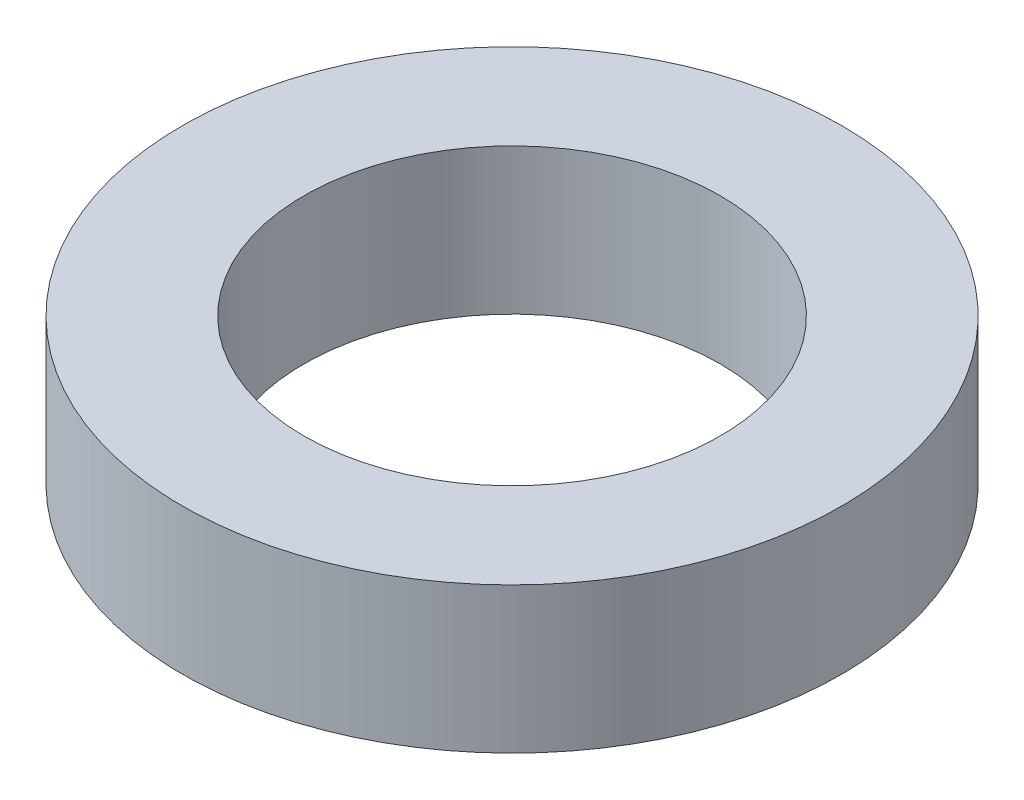
ISO-10303-21;
HEADER;
FILE_DESCRIPTION(('STEP AP214'),'2;1');
FILE_NAME('part.step','',(''),(''),'','','');
FILE_SCHEMA(('AUTOMOTIVE_DESIGN { 1 0 10303 214 1 1 1 1 }'));
ENDSEC;
DATA;
#1=APPLICATION_CONTEXT('core data for automotive mechanical design processes');
#2=APPLICATION_PROTOCOL_DEFINITION('international standard','automotive_design',2000,#1);
#3=PRODUCT_CONTEXT('',#1,'mechanical');
#4=PRODUCT('Part','Part','',(#3));
#5=PRODUCT_RELATED_PRODUCT_CATEGORY('part','',(#4));
#6=PRODUCT_DEFINITION_FORMATION('','',#4);
#7=PRODUCT_DEFINITION_CONTEXT('part definition',#1,'design');
#8=PRODUCT_DEFINITION('design','',#6,#7);
#9=PRODUCT_DEFINITION_SHAPE('','',#8);
#10=(LENGTH_UNIT() NAMED_UNIT(*) SI_UNIT(.MILLI.,.METRE.));
#11=(NAMED_UNIT(*) PLANE_ANGLE_UNIT() SI_UNIT($,.RADIAN.));
#12=(NAMED_UNIT(*) SI_UNIT($,.STERADIAN.) SOLID_ANGLE_UNIT());
#13=UNCERTAINTY_MEASURE_WITH_UNIT(LENGTH_MEASURE(1.E-05),#10,'distance_accuracy_value','');
#14=(GEOMETRIC_REPRESENTATION_CONTEXT(3) GLOBAL_UNCERTAINTY_ASSIGNED_CONTEXT((#13)) GLOBAL_UNIT_ASSIGNED_CONTEXT((#10,
#11,#12)) REPRESENTATION_CONTEXT('',''));
#15=CARTESIAN_POINT('',(0.,0.,0.));
#16=DIRECTION('',(0.,0.,1.));
#17=DIRECTION('',(1.,0.,0.));
#18=AXIS2_PLACEMENT_3D('',#15,#16,#17);
#19=CARTESIAN_POINT('',(0.,21.,0.));
#20=DIRECTION('',(0.,-1.,0.));
#21=DIRECTION('',(0.,0.,-1.));
#22=AXIS2_PLACEMENT_3D('',#19,#20,#21);
#23=CYLINDRICAL_SURFACE('',#22,47.5);
#24=CARTESIAN_POINT('',(0.,21.,0.));
#25=DIRECTION('',(0.,1.,0.));
#26=DIRECTION('',(0.,0.,1.));
#27=AXIS2_PLACEMENT_3D('',#24,#25,#26);
#28=CIRCLE('',#27,47.5);
#29=CARTESIAN_POINT('',(0.,21.,-47.5));
#30=VERTEX_POINT('',#29);
#31=EDGE_CURVE('E10',#30,#30,#28,.T.);
#32=CARTESIAN_POINT('',(0.,0.,0.));
#33=DIRECTION('',(0.,1.,0.));
#34=DIRECTION('',(0.,0.,1.));
#35=AXIS2_PLACEMENT_3D('',#32,#33,#34);
#36=CIRCLE('',#35,47.5);
#37=CARTESIAN_POINT('',(0.,0.,-47.5));
#38=VERTEX_POINT('',#37);
#39=EDGE_CURVE('E37',#38,#38,#36,.T.);
#40=CARTESIAN_POINT('',(0.,21.,-47.5));
#41=CARTESIAN_POINT('',(0.,20.78125,-47.5));
#42=CARTESIAN_POINT('',(0.,20.5625,-47.5));
#43=CARTESIAN_POINT('',(0.,20.125,-47.5));
#44=CARTESIAN_POINT('',(0.,19.90625,-47.5));
#45=CARTESIAN_POINT('',(0.,19.46875,-47.5));
#46=CARTESIAN_POINT('',(0.,19.25,-47.5));
#47=CARTESIAN_POINT('',(0.,18.8125,-47.5));
#48=CARTESIAN_POINT('',(0.,18.59375,-47.5));
#49=CARTESIAN_POINT('',(0.,18.15625,-47.5));
#50=CARTESIAN_POINT('',(0.,17.9375,-47.5));
#51=CARTESIAN_POINT('',(0.,17.5,-47.5));
#52=CARTESIAN_POINT('',(0.,17.28125,-47.5));
#53=CARTESIAN_POINT('',(0.,16.84375,-47.5));
#54=CARTESIAN_POINT('',(0.,16.625,-47.5));
#55=CARTESIAN_POINT('',(0.,16.1875,-47.5));
#56=CARTESIAN_POINT('',(0.,15.96875,-47.5));
#57=CARTESIAN_POINT('',(0.,15.53125,-47.5));
#58=CARTESIAN_POINT('',(0.,15.3125,-47.5));
#59=CARTESIAN_POINT('',(0.,14.875,-47.5));
#60=CARTESIAN_POINT('',(0.,14.65625,-47.5));
#61=CARTESIAN_POINT('',(0.,14.21875,-47.5));
#62=CARTESIAN_POINT('',(0.,14.,-47.5));
#63=CARTESIAN_POINT('',(0.,13.5625,-47.5));
#64=CARTESIAN_POINT('',(0.,13.34375,-47.5));
#65=CARTESIAN_POINT('',(0.,12.90625,-47.5));
#66=CARTESIAN_POINT('',(0.,12.6875,-47.5));
#67=CARTESIAN_POINT('',(0.,12.25,-47.5));
#68=CARTESIAN_POINT('',(0.,12.03125,-47.5));
#69=CARTESIAN_POINT('',(0.,11.59375,-47.5));
#70=CARTESIAN_POINT('',(0.,11.375,-47.5));
#71=CARTESIAN_POINT('',(0.,10.9375,-47.5));
#72=CARTESIAN_POINT('',(0.,10.71875,-47.5));
#73=CARTESIAN_POINT('',(0.,10.28125,-47.5));
#74=CARTESIAN_POINT('',(0.,10.0625,-47.5));
#75=CARTESIAN_POINT('',(0.,9.625,-47.5));
#76=CARTESIAN_POINT('',(0.,9.40625,-47.5));
#77=CARTESIAN_POINT('',(0.,8.96875,-47.5));
#78=CARTESIAN_POINT('',(0.,8.75,-47.5));
#79=CARTESIAN_POINT('',(0.,8.3125,-47.5));
#80=CARTESIAN_POINT('',(0.,8.09375,-47.5));
#81=CARTESIAN_POINT('',(0.,7.65625,-47.5));
#82=CARTESIAN_POINT('',(0.,7.4375,-47.5));
#83=CARTESIAN_POINT('',(0.,7.,-47.5));
#84=CARTESIAN_POINT('',(0.,6.78125,-47.5));
#85=CARTESIAN_POINT('',(0.,6.34375,-47.5));
#86=CARTESIAN_POINT('',(0.,6.125,-47.5));
#87=CARTESIAN_POINT('',(0.,5.6875,-47.5));
#88=CARTESIAN_POINT('',(0.,5.46875,-47.5));
#89=CARTESIAN_POINT('',(0.,5.03125,-47.5));
#90=CARTESIAN_POINT('',(0.,4.8125,-47.5));
#91=CARTESIAN_POINT('',(0.,4.375,-47.5));
#92=CARTESIAN_POINT('',(0.,4.15625,-47.5));
#93=CARTESIAN_POINT('',(0.,3.71875,-47.5));
#94=CARTESIAN_POINT('',(0.,3.5,-47.5));
#95=CARTESIAN_POINT('',(0.,3.0625,-47.5));
#96=CARTESIAN_POINT('',(0.,2.84375,-47.5));
#97=CARTESIAN_POINT('',(0.,2.40625,-47.5));
#98=CARTESIAN_POINT('',(0.,2.1875,-47.5));
#99=CARTESIAN_POINT('',(0.,1.75,-47.5));
#100=CARTESIAN_POINT('',(0.,1.53125,-47.5));
#101=CARTESIAN_POINT('',(0.,1.09375,-47.5));
#102=CARTESIAN_POINT('',(0.,0.875000000000001,-47.5));
#103=CARTESIAN_POINT('',(0.,0.4375,-47.5));
#104=CARTESIAN_POINT('',(0.,0.21875,-47.5));
#105=CARTESIAN_POINT('',(0.,0.,-47.5));
#106=B_SPLINE_CURVE_WITH_KNOTS('',3,(#40,#41,#42,#43,#44,#45,#46,#47,#48,#49,#50,#51,#52,#53,
#54,#55,#56,#57,#58,#59,#60,#61,#62,#63,#64,#65,#66,#67,#68,#69,#70,#71,#72,#73,#74,#75,#76,#77,
#78,#79,#80,#81,#82,#83,#84,#85,#86,#87,#88,#89,#90,#91,#92,#93,#94,#95,#96,#97,#98,#99,#100,
#101,#102,#103,#104,#105),.UNSPECIFIED.,.F.,.F.,(4,2,2,2,2,2,2,2,2,2,2,2,2,2,2,2,2,2,2,2,2,2,2,
2,2,2,2,2,2,2,2,2,4),(0.,0.656249999999997,1.3125,1.96875,2.625,3.28125,3.9375,4.59375,5.25,
5.90625,6.5625,7.21875,7.875,8.53125,9.1875,9.84375,10.5,11.15625,11.8125,12.46875,13.125,
13.78125,14.4375,15.09375,15.75,16.40625,17.0625,17.71875,18.375,19.03125,19.6875,20.34375,21.),.UNSPECIFIED.);
#107=EDGE_CURVE('BSEAM40',#30,#38,#106,.T.);
#108=ORIENTED_EDGE('',*,*,#31,.F.);
#109=ORIENTED_EDGE('',*,*,#39,.T.);
#110=ORIENTED_EDGE('',*,*,#107,.T.);
#111=ORIENTED_EDGE('',*,*,#107,.F.);
#112=EDGE_LOOP('',(#108,#110,#109,#111));
#113=FACE_BOUND('',#112,.T.);
#114=ADVANCED_FACE('F40',(#113),#23,.T.);
#115=CARTESIAN_POINT('',(0.,21.,0.));
#116=DIRECTION('',(0.,1.,0.));
#117=DIRECTION('',(0.,0.,1.));
#118=AXIS2_PLACEMENT_3D('',#115,#116,#117);
#119=PLANE('',#118);
#120=CARTESIAN_POINT('',(0.,21.,0.));
#121=DIRECTION('',(0.,1.,0.));
#122=DIRECTION('',(0.,0.,1.));
#123=AXIS2_PLACEMENT_3D('',#120,#121,#122);
#124=CIRCLE('',#123,30.);
#125=CARTESIAN_POINT('',(0.,21.,-30.));
#126=VERTEX_POINT('',#125);
#127=EDGE_CURVE('E50',#126,#126,#124,.T.);
#128=ORIENTED_EDGE('',*,*,#127,.F.);
#129=EDGE_LOOP('',(#128));
#130=FACE_BOUND('',#129,.T.);
#131=ORIENTED_EDGE('',*,*,#31,.T.);
#132=EDGE_LOOP('',(#131));
#133=FACE_BOUND('',#132,.T.);
#134=ADVANCED_FACE('F59',(#130,#133),#119,.T.);
#135=CARTESIAN_POINT('',(0.,0.,0.));
#136=DIRECTION('',(0.,1.,0.));
#137=DIRECTION('',(0.,0.,1.));
#138=AXIS2_PLACEMENT_3D('',#135,#136,#137);
#139=PLANE('',#138);
#140=CARTESIAN_POINT('',(0.,0.,0.));
#141=DIRECTION('',(0.,1.,0.));
#142=DIRECTION('',(0.,0.,1.));
#143=AXIS2_PLACEMENT_3D('',#140,#141,#142);
#144=CIRCLE('',#143,30.);
#145=CARTESIAN_POINT('',(0.,0.,-30.));
#146=VERTEX_POINT('',#145);
#147=EDGE_CURVE('E47',#146,#146,#144,.T.);
#148=ORIENTED_EDGE('',*,*,#147,.T.);
#149=EDGE_LOOP('',(#148));
#150=FACE_BOUND('',#149,.T.);
#151=ORIENTED_EDGE('',*,*,#39,.F.);
#152=EDGE_LOOP('',(#151));
#153=FACE_BOUND('',#152,.T.);
#154=ADVANCED_FACE('F58',(#150,#153),#139,.F.);
#155=CARTESIAN_POINT('',(0.,21.,0.));
#156=DIRECTION('',(0.,-1.,0.));
#157=DIRECTION('',(0.,0.,-1.));
#158=AXIS2_PLACEMENT_3D('',#155,#156,#157);
#159=CYLINDRICAL_SURFACE('',#158,30.);
#160=CARTESIAN_POINT('',(0.,21.,-30.));
#161=CARTESIAN_POINT('',(0.,20.78125,-30.));
#162=CARTESIAN_POINT('',(0.,20.5625,-30.));
#163=CARTESIAN_POINT('',(0.,20.125,-30.));
#164=CARTESIAN_POINT('',(0.,19.90625,-30.));
#165=CARTESIAN_POINT('',(0.,19.46875,-30.));
#166=CARTESIAN_POINT('',(0.,19.25,-30.));
#167=CARTESIAN_POINT('',(0.,18.8125,-30.));
#168=CARTESIAN_POINT('',(0.,18.59375,-30.));
#169=CARTESIAN_POINT('',(0.,18.15625,-30.));
#170=CARTESIAN_POINT('',(0.,17.9375,-30.));
#171=CARTESIAN_POINT('',(0.,17.5,-30.));
#172=CARTESIAN_POINT('',(0.,17.28125,-30.));
#173=CARTESIAN_POINT('',(0.,16.84375,-30.));
#174=CARTESIAN_POINT('',(0.,16.625,-30.));
#175=CARTESIAN_POINT('',(0.,16.1875,-30.));
#176=CARTESIAN_POINT('',(0.,15.96875,-30.));
#177=CARTESIAN_POINT('',(0.,15.53125,-30.));
#178=CARTESIAN_POINT('',(0.,15.3125,-30.));
#179=CARTESIAN_POINT('',(0.,14.875,-30.));
#180=CARTESIAN_POINT('',(0.,14.65625,-30.));
#181=CARTESIAN_POINT('',(0.,14.21875,-30.));
#182=CARTESIAN_POINT('',(0.,14.,-30.));
#183=CARTESIAN_POINT('',(0.,13.5625,-30.));
#184=CARTESIAN_POINT('',(0.,13.34375,-30.));
#185=CARTESIAN_POINT('',(0.,12.90625,-30.));
#186=CARTESIAN_POINT('',(0.,12.6875,-30.));
#187=CARTESIAN_POINT('',(0.,12.25,-30.));
#188=CARTESIAN_POINT('',(0.,12.03125,-30.));
#189=CARTESIAN_POINT('',(0.,11.59375,-30.));
#190=CARTESIAN_POINT('',(0.,11.375,-30.));
#191=CARTESIAN_POINT('',(0.,10.9375,-30.));
#192=CARTESIAN_POINT('',(0.,10.71875,-30.));
#193=CARTESIAN_POINT('',(0.,10.28125,-30.));
#194=CARTESIAN_POINT('',(0.,10.0625,-30.));
#195=CARTESIAN_POINT('',(0.,9.625,-30.));
#196=CARTESIAN_POINT('',(0.,9.40625,-30.));
#197=CARTESIAN_POINT('',(0.,8.96875,-30.));
#198=CARTESIAN_POINT('',(0.,8.75,-30.));
#199=CARTESIAN_POINT('',(0.,8.3125,-30.));
#200=CARTESIAN_POINT('',(0.,8.09375,-30.));
#201=CARTESIAN_POINT('',(0.,7.65625,-30.));
#202=CARTESIAN_POINT('',(0.,7.4375,-30.));
#203=CARTESIAN_POINT('',(0.,7.,-30.));
#204=CARTESIAN_POINT('',(0.,6.78125,-30.));
#205=CARTESIAN_POINT('',(0.,6.34375,-30.));
#206=CARTESIAN_POINT('',(0.,6.125,-30.));
#207=CARTESIAN_POINT('',(0.,5.6875,-30.));
#208=CARTESIAN_POINT('',(0.,5.46875,-30.));
#209=CARTESIAN_POINT('',(0.,5.03125,-30.));
#210=CARTESIAN_POINT('',(0.,4.8125,-30.));
#211=CARTESIAN_POINT('',(0.,4.375,-30.));
#212=CARTESIAN_POINT('',(0.,4.15625,-30.));
#213=CARTESIAN_POINT('',(0.,3.71875,-30.));
#214=CARTESIAN_POINT('',(0.,3.5,-30.));
#215=CARTESIAN_POINT('',(0.,3.0625,-30.));
#216=CARTESIAN_POINT('',(0.,2.84375,-30.));
#217=CARTESIAN_POINT('',(0.,2.40625,-30.));
#218=CARTESIAN_POINT('',(0.,2.1875,-30.));
#219=CARTESIAN_POINT('',(0.,1.75,-30.));
#220=CARTESIAN_POINT('',(0.,1.53125,-30.));
#221=CARTESIAN_POINT('',(0.,1.09375,-30.));
#222=CARTESIAN_POINT('',(0.,0.875000000000001,-30.));
#223=CARTESIAN_POINT('',(0.,0.4375,-30.));
#224=CARTESIAN_POINT('',(0.,0.21875,-30.));
#225=CARTESIAN_POINT('',(0.,0.,-30.));
#226=B_SPLINE_CURVE_WITH_KNOTS('',3,(#160,#161,#162,#163,#164,#165,#166,#167,#168,#169,#170,
#171,#172,#173,#174,#175,#176,#177,#178,#179,#180,#181,#182,#183,#184,#185,#186,#187,#188,#189,
#190,#191,#192,#193,#194,#195,#196,#197,#198,#199,#200,#201,#202,#203,#204,#205,#206,#207,#208,
#209,#210,#211,#212,#213,#214,#215,#216,#217,#218,#219,#220,#221,#222,#223,#224,#225),
.UNSPECIFIED.,.F.,.F.,(4,2,2,2,2,2,2,2,2,2,2,2,2,2,2,2,2,2,2,2,2,2,2,2,2,2,2,2,2,2,2,2,4),(0.,
0.656249999999997,1.3125,1.96875,2.625,3.28125,3.9375,4.59375,5.25,5.90625,6.5625,7.21875,7.875,
8.53125,9.1875,9.84375,10.5,11.15625,11.8125,12.46875,13.125,13.78125,14.4375,15.09375,15.75,
16.40625,17.0625,17.71875,18.375,19.03125,19.6875,20.34375,21.),.UNSPECIFIED.);
#227=EDGE_CURVE('BSEAM54',#126,#146,#226,.T.);
#228=ORIENTED_EDGE('',*,*,#127,.T.);
#229=ORIENTED_EDGE('',*,*,#147,.F.);
#230=ORIENTED_EDGE('',*,*,#227,.T.);
#231=ORIENTED_EDGE('',*,*,#227,.F.);
#232=EDGE_LOOP('',(#228,#230,#229,#231));
#233=FACE_BOUND('',#232,.T.);
#234=ADVANCED_FACE('F54',(#233),#159,.F.);
#235=CLOSED_SHELL('',(#114,#134,#154,#234));
#236=MANIFOLD_SOLID_BREP('B2',#235);
#237=ADVANCED_BREP_SHAPE_REPRESENTATION('',(#18,#236),#14);
#238=SHAPE_DEFINITION_REPRESENTATION(#9,#237);
ENDSEC;
END-ISO-10303-21;
